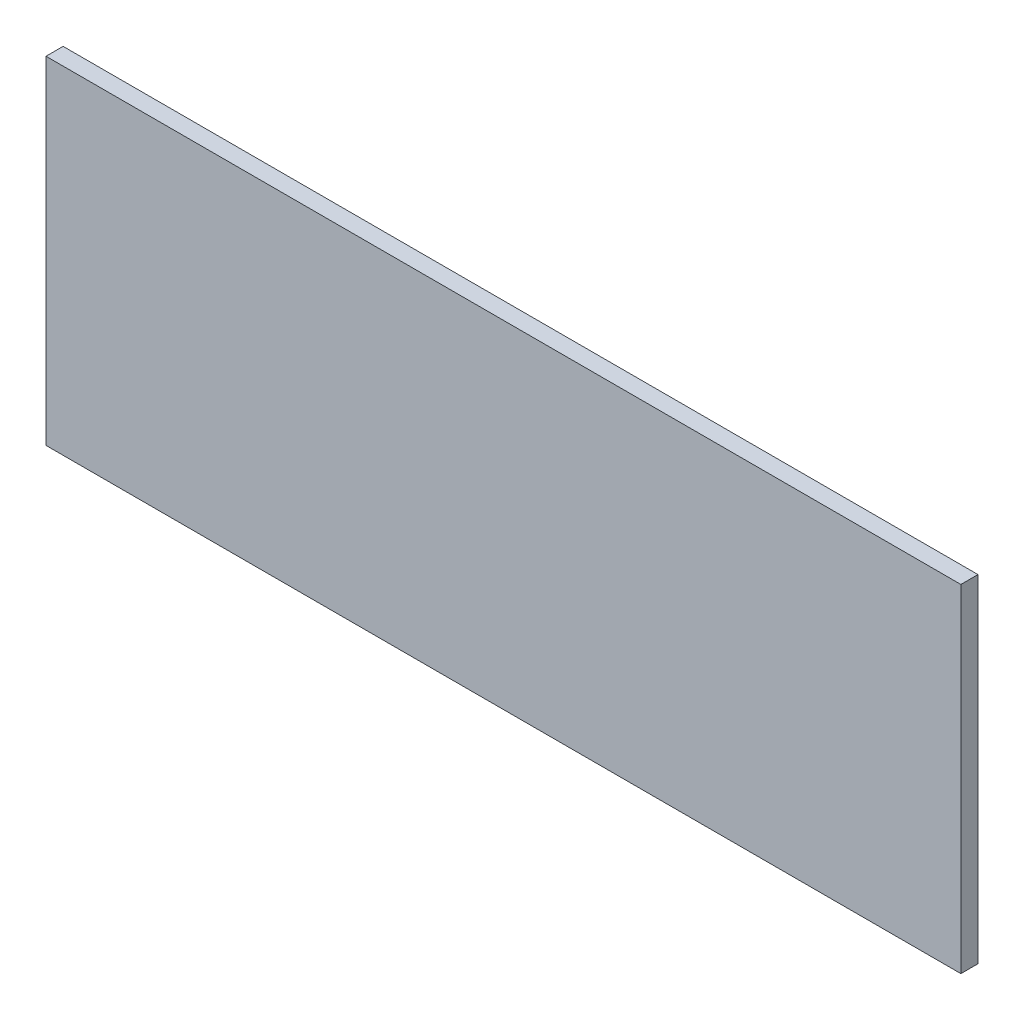
ISO-10303-21;
HEADER;
FILE_DESCRIPTION(('STEP AP214'),'2;1');
FILE_NAME('part.step','',(''),(''),'','','');
FILE_SCHEMA(('AUTOMOTIVE_DESIGN { 1 0 10303 214 1 1 1 1 }'));
ENDSEC;
DATA;
#1=APPLICATION_CONTEXT('core data for automotive mechanical design processes');
#2=APPLICATION_PROTOCOL_DEFINITION('international standard','automotive_design',2000,#1);
#3=PRODUCT_CONTEXT('',#1,'mechanical');
#4=PRODUCT('Part','Part','',(#3));
#5=PRODUCT_RELATED_PRODUCT_CATEGORY('part','',(#4));
#6=PRODUCT_DEFINITION_FORMATION('','',#4);
#7=PRODUCT_DEFINITION_CONTEXT('part definition',#1,'design');
#8=PRODUCT_DEFINITION('design','',#6,#7);
#9=PRODUCT_DEFINITION_SHAPE('','',#8);
#10=(LENGTH_UNIT() NAMED_UNIT(*) SI_UNIT(.MILLI.,.METRE.));
#11=(NAMED_UNIT(*) PLANE_ANGLE_UNIT() SI_UNIT($,.RADIAN.));
#12=(NAMED_UNIT(*) SI_UNIT($,.STERADIAN.) SOLID_ANGLE_UNIT());
#13=UNCERTAINTY_MEASURE_WITH_UNIT(LENGTH_MEASURE(1.E-05),#10,'distance_accuracy_value','');
#14=(GEOMETRIC_REPRESENTATION_CONTEXT(3) GLOBAL_UNCERTAINTY_ASSIGNED_CONTEXT((#13)) GLOBAL_UNIT_ASSIGNED_CONTEXT((#10,
#11,#12)) REPRESENTATION_CONTEXT('',''));
#15=CARTESIAN_POINT('',(0.,0.,0.));
#16=DIRECTION('',(0.,0.,1.));
#17=DIRECTION('',(1.,0.,0.));
#18=AXIS2_PLACEMENT_3D('',#15,#16,#17);
#19=CARTESIAN_POINT('',(81.8669967651367,70.0869979858398,0.));
#20=DIRECTION('',(0.,1.,0.));
#21=DIRECTION('',(1.,0.,0.));
#22=AXIS2_PLACEMENT_3D('',#19,#20,#21);
#23=PLANE('',#22);
#24=DIRECTION('',(1.,0.,0.));
#25=VECTOR('',#24,1.);
#26=CARTESIAN_POINT('',(81.8669967651367,70.0869979858398,0.03556));
#27=LINE('',#26,#25);
#28=CARTESIAN_POINT('',(81.8669967651367,70.0869979858398,0.03556));
#29=VERTEX_POINT('',#28);
#30=CARTESIAN_POINT('',(83.7669982910156,70.0869979858398,0.03556));
#31=VERTEX_POINT('',#30);
#32=EDGE_CURVE('E11',#29,#31,#27,.T.);
#33=ORIENTED_EDGE('',*,*,#32,.F.);
#34=DIRECTION('',(0.,0.,1.));
#35=VECTOR('',#34,1.);
#36=CARTESIAN_POINT('',(81.8669967651367,70.0869979858398,0.));
#37=LINE('',#36,#35);
#38=CARTESIAN_POINT('',(81.8669967651367,70.0869979858398,0.));
#39=VERTEX_POINT('',#38);
#40=EDGE_CURVE('E24',#39,#29,#37,.T.);
#41=ORIENTED_EDGE('',*,*,#40,.F.);
#42=DIRECTION('',(1.,0.,0.));
#43=VECTOR('',#42,1.);
#44=CARTESIAN_POINT('',(81.8669967651367,70.0869979858398,0.));
#45=LINE('',#44,#43);
#46=CARTESIAN_POINT('',(83.7669982910156,70.0869979858398,0.));
#47=VERTEX_POINT('',#46);
#48=EDGE_CURVE('E75',#39,#47,#45,.T.);
#49=ORIENTED_EDGE('',*,*,#48,.T.);
#50=DIRECTION('',(0.,0.,1.));
#51=VECTOR('',#50,1.);
#52=CARTESIAN_POINT('',(83.7669982910156,70.0869979858398,0.));
#53=LINE('',#52,#51);
#54=EDGE_CURVE('E37',#47,#31,#53,.T.);
#55=ORIENTED_EDGE('',*,*,#54,.T.);
#56=EDGE_LOOP('',(#33,#41,#49,#55));
#57=FACE_BOUND('',#56,.T.);
#58=ADVANCED_FACE('F17',(#57),#23,.F.);
#59=CARTESIAN_POINT('',(83.7669982910156,70.0869979858398,0.));
#60=DIRECTION('',(-1.,0.,0.));
#61=DIRECTION('',(0.,1.,0.));
#62=AXIS2_PLACEMENT_3D('',#59,#60,#61);
#63=PLANE('',#62);
#64=DIRECTION('',(0.,1.,0.));
#65=VECTOR('',#64,1.);
#66=CARTESIAN_POINT('',(83.7669982910156,70.0869979858398,0.03556));
#67=LINE('',#66,#65);
#68=CARTESIAN_POINT('',(83.7669982910156,70.7870025634766,0.03556));
#69=VERTEX_POINT('',#68);
#70=EDGE_CURVE('E83',#31,#69,#67,.T.);
#71=ORIENTED_EDGE('',*,*,#70,.F.);
#72=ORIENTED_EDGE('',*,*,#54,.F.);
#73=DIRECTION('',(0.,1.,0.));
#74=VECTOR('',#73,1.);
#75=CARTESIAN_POINT('',(83.7669982910156,70.0869979858398,0.));
#76=LINE('',#75,#74);
#77=CARTESIAN_POINT('',(83.7669982910156,70.7870025634766,0.));
#78=VERTEX_POINT('',#77);
#79=EDGE_CURVE('E81',#47,#78,#76,.T.);
#80=ORIENTED_EDGE('',*,*,#79,.T.);
#81=DIRECTION('',(0.,0.,1.));
#82=VECTOR('',#81,1.);
#83=CARTESIAN_POINT('',(83.7669982910156,70.7870025634766,0.));
#84=LINE('',#83,#82);
#85=EDGE_CURVE('E67',#78,#69,#84,.T.);
#86=ORIENTED_EDGE('',*,*,#85,.T.);
#87=EDGE_LOOP('',(#71,#72,#80,#86));
#88=FACE_BOUND('',#87,.T.);
#89=ADVANCED_FACE('F89',(#88),#63,.F.);
#90=CARTESIAN_POINT('',(83.7669982910156,70.7870025634766,0.));
#91=DIRECTION('',(0.,-1.,0.));
#92=DIRECTION('',(-1.,0.,0.));
#93=AXIS2_PLACEMENT_3D('',#90,#91,#92);
#94=PLANE('',#93);
#95=DIRECTION('',(-1.,0.,0.));
#96=VECTOR('',#95,1.);
#97=CARTESIAN_POINT('',(83.7669982910156,70.7870025634766,0.03556));
#98=LINE('',#97,#96);
#99=CARTESIAN_POINT('',(81.8669967651367,70.7870025634766,0.03556));
#100=VERTEX_POINT('',#99);
#101=EDGE_CURVE('E71',#69,#100,#98,.T.);
#102=ORIENTED_EDGE('',*,*,#101,.F.);
#103=ORIENTED_EDGE('',*,*,#85,.F.);
#104=DIRECTION('',(-1.,0.,0.));
#105=VECTOR('',#104,1.);
#106=CARTESIAN_POINT('',(83.7669982910156,70.7870025634766,0.));
#107=LINE('',#106,#105);
#108=CARTESIAN_POINT('',(81.8669967651367,70.7870025634766,0.));
#109=VERTEX_POINT('',#108);
#110=EDGE_CURVE('E63',#78,#109,#107,.T.);
#111=ORIENTED_EDGE('',*,*,#110,.T.);
#112=DIRECTION('',(0.,0.,1.));
#113=VECTOR('',#112,1.);
#114=CARTESIAN_POINT('',(81.8669967651367,70.7870025634766,0.));
#115=LINE('',#114,#113);
#116=EDGE_CURVE('E53',#109,#100,#115,.T.);
#117=ORIENTED_EDGE('',*,*,#116,.T.);
#118=EDGE_LOOP('',(#102,#103,#111,#117));
#119=FACE_BOUND('',#118,.T.);
#120=ADVANCED_FACE('F66',(#119),#94,.F.);
#121=CARTESIAN_POINT('',(81.8669967651367,70.7870025634766,0.));
#122=DIRECTION('',(1.,0.,0.));
#123=DIRECTION('',(0.,-1.,0.));
#124=AXIS2_PLACEMENT_3D('',#121,#122,#123);
#125=PLANE('',#124);
#126=DIRECTION('',(0.,-1.,0.));
#127=VECTOR('',#126,1.);
#128=CARTESIAN_POINT('',(81.8669967651367,70.7870025634766,0.03556));
#129=LINE('',#128,#127);
#130=EDGE_CURVE('E59',#100,#29,#129,.T.);
#131=ORIENTED_EDGE('',*,*,#130,.F.);
#132=ORIENTED_EDGE('',*,*,#116,.F.);
#133=DIRECTION('',(0.,-1.,0.));
#134=VECTOR('',#133,1.);
#135=CARTESIAN_POINT('',(81.8669967651367,70.7870025634766,0.));
#136=LINE('',#135,#134);
#137=EDGE_CURVE('E57',#109,#39,#136,.T.);
#138=ORIENTED_EDGE('',*,*,#137,.T.);
#139=ORIENTED_EDGE('',*,*,#40,.T.);
#140=EDGE_LOOP('',(#131,#132,#138,#139));
#141=FACE_BOUND('',#140,.T.);
#142=ADVANCED_FACE('F55',(#141),#125,.F.);
#143=CARTESIAN_POINT('',(81.8669967651367,70.0869979858398,0.));
#144=DIRECTION('',(0.,0.,-1.));
#145=DIRECTION('',(-1.,0.,0.));
#146=AXIS2_PLACEMENT_3D('',#143,#144,#145);
#147=PLANE('',#146);
#148=ORIENTED_EDGE('',*,*,#137,.F.);
#149=ORIENTED_EDGE('',*,*,#110,.F.);
#150=ORIENTED_EDGE('',*,*,#79,.F.);
#151=ORIENTED_EDGE('',*,*,#48,.F.);
#152=EDGE_LOOP('',(#148,#149,#150,#151));
#153=FACE_BOUND('',#152,.T.);
#154=ADVANCED_FACE('F74',(#153),#147,.T.);
#155=CARTESIAN_POINT('',(81.8669967651367,70.0869979858398,0.03556));
#156=DIRECTION('',(0.,0.,-1.));
#157=DIRECTION('',(-1.,0.,0.));
#158=AXIS2_PLACEMENT_3D('',#155,#156,#157);
#159=PLANE('',#158);
#160=ORIENTED_EDGE('',*,*,#32,.T.);
#161=ORIENTED_EDGE('',*,*,#70,.T.);
#162=ORIENTED_EDGE('',*,*,#101,.T.);
#163=ORIENTED_EDGE('',*,*,#130,.T.);
#164=EDGE_LOOP('',(#160,#161,#162,#163));
#165=FACE_BOUND('',#164,.T.);
#166=ADVANCED_FACE('F91',(#165),#159,.F.);
#167=CLOSED_SHELL('',(#58,#89,#120,#142,#154,#166));
#168=MANIFOLD_SOLID_BREP('B1',#167);
#169=ADVANCED_BREP_SHAPE_REPRESENTATION('',(#18,#168),#14);
#170=SHAPE_DEFINITION_REPRESENTATION(#9,#169);
ENDSEC;
END-ISO-10303-21;
